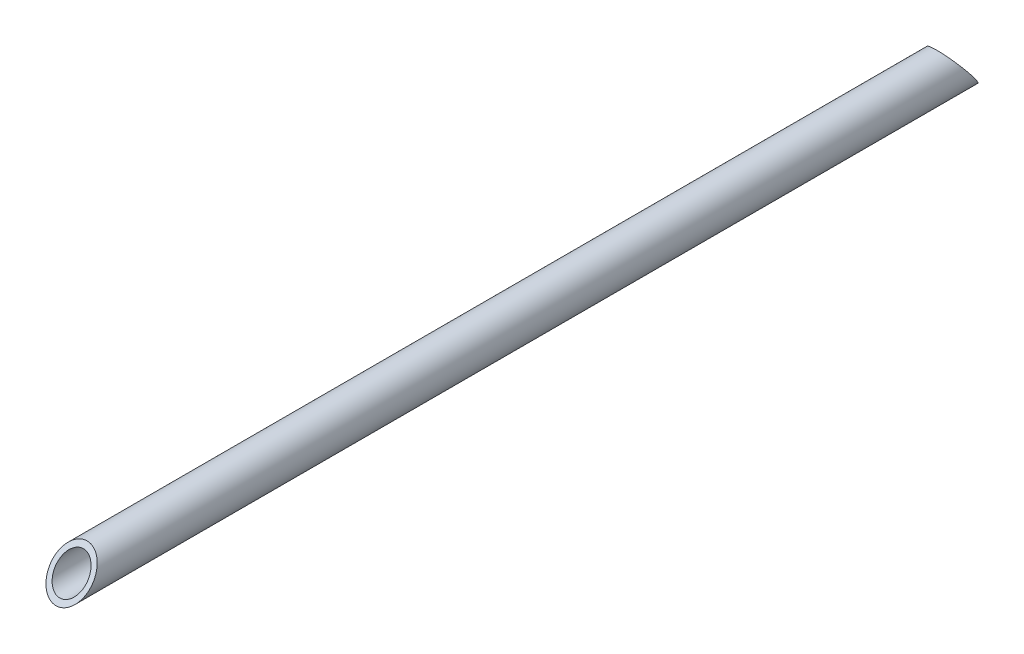
ISO-10303-21;
HEADER;
FILE_DESCRIPTION(('STEP AP214'),'2;1');
FILE_NAME('part.step','',(''),(''),'','','');
FILE_SCHEMA(('AUTOMOTIVE_DESIGN { 1 0 10303 214 1 1 1 1 }'));
ENDSEC;
DATA;
#1=APPLICATION_CONTEXT('core data for automotive mechanical design processes');
#2=APPLICATION_PROTOCOL_DEFINITION('international standard','automotive_design',2000,#1);
#3=PRODUCT_CONTEXT('',#1,'mechanical');
#4=PRODUCT('Part','Part','',(#3));
#5=PRODUCT_RELATED_PRODUCT_CATEGORY('part','',(#4));
#6=PRODUCT_DEFINITION_FORMATION('','',#4);
#7=PRODUCT_DEFINITION_CONTEXT('part definition',#1,'design');
#8=PRODUCT_DEFINITION('design','',#6,#7);
#9=PRODUCT_DEFINITION_SHAPE('','',#8);
#10=(LENGTH_UNIT() NAMED_UNIT(*) SI_UNIT(.MILLI.,.METRE.));
#11=(NAMED_UNIT(*) PLANE_ANGLE_UNIT() SI_UNIT($,.RADIAN.));
#12=(NAMED_UNIT(*) SI_UNIT($,.STERADIAN.) SOLID_ANGLE_UNIT());
#13=UNCERTAINTY_MEASURE_WITH_UNIT(LENGTH_MEASURE(1.E-05),#10,'distance_accuracy_value','');
#14=(GEOMETRIC_REPRESENTATION_CONTEXT(3) GLOBAL_UNCERTAINTY_ASSIGNED_CONTEXT((#13)) GLOBAL_UNIT_ASSIGNED_CONTEXT((#10,
#11,#12)) REPRESENTATION_CONTEXT('',''));
#15=CARTESIAN_POINT('',(0.,0.,0.));
#16=DIRECTION('',(0.,0.,1.));
#17=DIRECTION('',(1.,0.,0.));
#18=AXIS2_PLACEMENT_3D('',#15,#16,#17);
#19=CARTESIAN_POINT('',(1799.99999999996,-4.18286707223905E-12,275.));
#20=DIRECTION('',(0.,0.,-1.));
#21=DIRECTION('',(-1.,0.,0.));
#22=AXIS2_PLACEMENT_3D('',#19,#20,#21);
#23=CYLINDRICAL_SURFACE('',#22,9.65000000000003);
#24=CARTESIAN_POINT('',(1799.99999999996,-4.18286707223905E-12,275.));
#25=DIRECTION('',(0.,-0.607627934708573,-0.79422181596944));
#26=DIRECTION('',(0.,0.79422181596944,-0.607627934708573));
#27=AXIS2_PLACEMENT_3D('',#24,#25,#26);
#28=ELLIPSE('',#27,12.1502580336717,9.65000000000003);
#29=CARTESIAN_POINT('',(1799.99999999996,9.64999999999585,267.617163804824));
#30=VERTEX_POINT('',#29);
#31=EDGE_CURVE('E47',#30,#30,#28,.T.);
#32=ORIENTED_EDGE('',*,*,#31,.F.);
#33=EDGE_LOOP('',(#32));
#34=FACE_BOUND('',#33,.T.);
#35=CARTESIAN_POINT('',(1799.99999999996,-4.18286707223905E-12,-275.000000000001));
#36=DIRECTION('',(0.,-0.607627934708573,0.794221815969439));
#37=DIRECTION('',(0.,-0.794221815969439,-0.607627934708573));
#38=AXIS2_PLACEMENT_3D('',#35,#36,#37);
#39=ELLIPSE('',#38,12.1502580336717,9.65000000000003);
#40=CARTESIAN_POINT('',(1799.99999999996,-9.65000000000421,-282.382836195177));
#41=VERTEX_POINT('',#40);
#42=EDGE_CURVE('E60',#41,#41,#39,.T.);
#43=ORIENTED_EDGE('',*,*,#42,.F.);
#44=EDGE_LOOP('',(#43));
#45=FACE_BOUND('',#44,.T.);
#46=ADVANCED_FACE('F40',(#34,#45),#23,.F.);
#47=CARTESIAN_POINT('',(1799.99999999996,-3.99647548572801E-12,-275.000000000001));
#48=DIRECTION('',(0.,-0.607627934708573,0.794221815969439));
#49=DIRECTION('',(0.,-0.794221815969439,-0.607627934708573));
#50=AXIS2_PLACEMENT_3D('',#47,#48,#49);
#51=PLANE('',#50);
#52=ORIENTED_EDGE('',*,*,#42,.T.);
#53=EDGE_LOOP('',(#52));
#54=FACE_BOUND('',#53,.T.);
#55=CARTESIAN_POINT('',(1799.99999999996,-4.18286707223905E-12,-275.000000000001));
#56=DIRECTION('',(0.,-0.607627934708573,0.794221815969439));
#57=DIRECTION('',(0.,-0.794221815969439,-0.607627934708573));
#58=AXIS2_PLACEMENT_3D('',#55,#56,#57);
#59=ELLIPSE('',#58,15.9904950287701,12.7000000000001);
#60=CARTESIAN_POINT('',(1799.99999999996,-12.7000000000043,-284.7162714693));
#61=VERTEX_POINT('',#60);
#62=EDGE_CURVE('E53',#61,#61,#59,.T.);
#63=ORIENTED_EDGE('',*,*,#62,.F.);
#64=EDGE_LOOP('',(#63));
#65=FACE_BOUND('',#64,.T.);
#66=ADVANCED_FACE('F67',(#54,#65),#51,.F.);
#67=CARTESIAN_POINT('',(1799.99999999996,-4.18286707223905E-12,275.));
#68=DIRECTION('',(0.,0.,-1.));
#69=DIRECTION('',(-1.,0.,0.));
#70=AXIS2_PLACEMENT_3D('',#67,#68,#69);
#71=CYLINDRICAL_SURFACE('',#70,12.7000000000001);
#72=CARTESIAN_POINT('',(1799.99999999996,-4.18286707223905E-12,275.));
#73=DIRECTION('',(0.,-0.607627934708573,-0.79422181596944));
#74=DIRECTION('',(0.,0.79422181596944,-0.607627934708573));
#75=AXIS2_PLACEMENT_3D('',#72,#73,#74);
#76=ELLIPSE('',#75,15.9904950287701,12.7000000000001);
#77=CARTESIAN_POINT('',(1799.99999999996,12.6999999999959,265.283728530701));
#78=VERTEX_POINT('',#77);
#79=EDGE_CURVE('E10',#78,#78,#76,.T.);
#80=ORIENTED_EDGE('',*,*,#79,.T.);
#81=EDGE_LOOP('',(#80));
#82=FACE_BOUND('',#81,.T.);
#83=ORIENTED_EDGE('',*,*,#62,.T.);
#84=EDGE_LOOP('',(#83));
#85=FACE_BOUND('',#84,.T.);
#86=ADVANCED_FACE('F75',(#82,#85),#71,.T.);
#87=CARTESIAN_POINT('',(1799.99999999996,-4.16280375544669E-12,275.));
#88=DIRECTION('',(0.,-0.607627934708573,-0.79422181596944));
#89=DIRECTION('',(0.,0.79422181596944,-0.607627934708573));
#90=AXIS2_PLACEMENT_3D('',#87,#88,#89);
#91=PLANE('',#90);
#92=ORIENTED_EDGE('',*,*,#31,.T.);
#93=EDGE_LOOP('',(#92));
#94=FACE_BOUND('',#93,.T.);
#95=ORIENTED_EDGE('',*,*,#79,.F.);
#96=EDGE_LOOP('',(#95));
#97=FACE_BOUND('',#96,.T.);
#98=ADVANCED_FACE('F80',(#94,#97),#91,.F.);
#99=CLOSED_SHELL('',(#46,#66,#86,#98));
#100=MANIFOLD_SOLID_BREP('B2',#99);
#101=ADVANCED_BREP_SHAPE_REPRESENTATION('',(#18,#100),#14);
#102=SHAPE_DEFINITION_REPRESENTATION(#9,#101);
ENDSEC;
END-ISO-10303-21;
